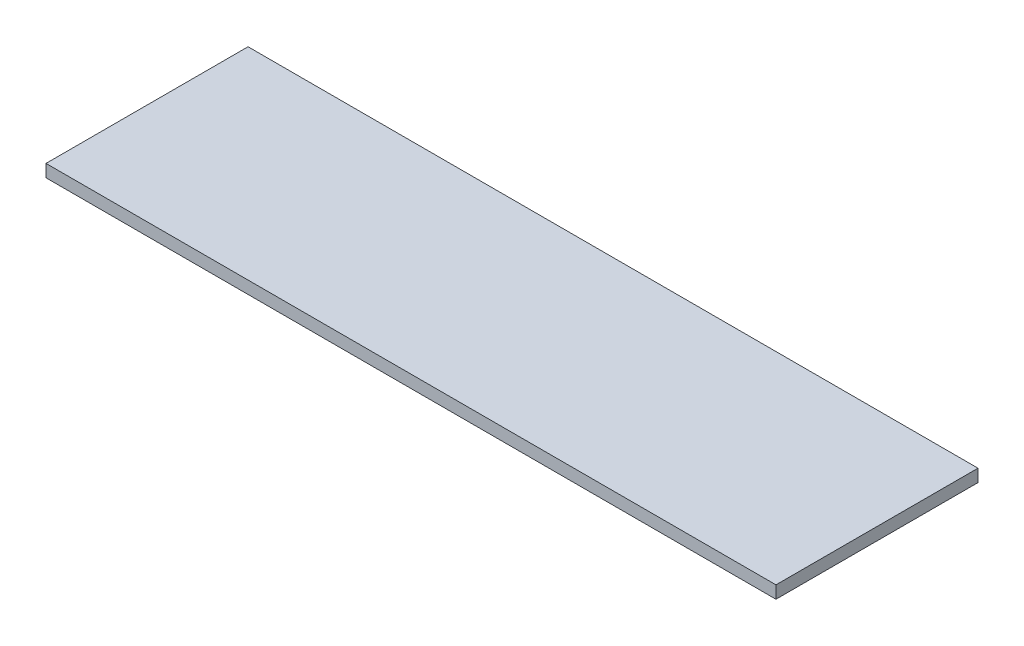
ISO-10303-21;
HEADER;
FILE_DESCRIPTION(('STEP AP214'),'2;1');
FILE_NAME('part.step','',(''),(''),'','','');
FILE_SCHEMA(('AUTOMOTIVE_DESIGN { 1 0 10303 214 1 1 1 1 }'));
ENDSEC;
DATA;
#1=APPLICATION_CONTEXT('core data for automotive mechanical design processes');
#2=APPLICATION_PROTOCOL_DEFINITION('international standard','automotive_design',2000,#1);
#3=PRODUCT_CONTEXT('',#1,'mechanical');
#4=PRODUCT('Part','Part','',(#3));
#5=PRODUCT_RELATED_PRODUCT_CATEGORY('part','',(#4));
#6=PRODUCT_DEFINITION_FORMATION('','',#4);
#7=PRODUCT_DEFINITION_CONTEXT('part definition',#1,'design');
#8=PRODUCT_DEFINITION('design','',#6,#7);
#9=PRODUCT_DEFINITION_SHAPE('','',#8);
#10=(LENGTH_UNIT() NAMED_UNIT(*) SI_UNIT(.MILLI.,.METRE.));
#11=(NAMED_UNIT(*) PLANE_ANGLE_UNIT() SI_UNIT($,.RADIAN.));
#12=(NAMED_UNIT(*) SI_UNIT($,.STERADIAN.) SOLID_ANGLE_UNIT());
#13=UNCERTAINTY_MEASURE_WITH_UNIT(LENGTH_MEASURE(1.E-05),#10,'distance_accuracy_value','');
#14=(GEOMETRIC_REPRESENTATION_CONTEXT(3) GLOBAL_UNCERTAINTY_ASSIGNED_CONTEXT((#13)) GLOBAL_UNIT_ASSIGNED_CONTEXT((#10,
#11,#12)) REPRESENTATION_CONTEXT('',''));
#15=CARTESIAN_POINT('',(0.,0.,0.));
#16=DIRECTION('',(0.,0.,1.));
#17=DIRECTION('',(1.,0.,0.));
#18=AXIS2_PLACEMENT_3D('',#15,#16,#17);
#19=CARTESIAN_POINT('',(533.4,18.25625,147.6375));
#20=DIRECTION('',(-1.,0.,0.));
#21=DIRECTION('',(0.,0.,1.));
#22=AXIS2_PLACEMENT_3D('',#19,#20,#21);
#23=PLANE('',#22);
#24=DIRECTION('',(0.,0.,-1.));
#25=VECTOR('',#24,1.);
#26=CARTESIAN_POINT('',(533.4,0.,147.6375));
#27=LINE('',#26,#25);
#28=CARTESIAN_POINT('',(533.4,0.,147.6375));
#29=VERTEX_POINT('',#28);
#30=CARTESIAN_POINT('',(533.4,0.,-147.6375));
#31=VERTEX_POINT('',#30);
#32=EDGE_CURVE('E95',#29,#31,#27,.T.);
#33=ORIENTED_EDGE('',*,*,#32,.T.);
#34=DIRECTION('',(0.,-1.,0.));
#35=VECTOR('',#34,1.);
#36=CARTESIAN_POINT('',(533.4,18.25625,-147.6375));
#37=LINE('',#36,#35);
#38=CARTESIAN_POINT('',(533.4,18.25625,-147.6375));
#39=VERTEX_POINT('',#38);
#40=EDGE_CURVE('E11',#39,#31,#37,.T.);
#41=ORIENTED_EDGE('',*,*,#40,.F.);
#42=DIRECTION('',(0.,0.,-1.));
#43=VECTOR('',#42,1.);
#44=CARTESIAN_POINT('',(533.4,18.25625,147.6375));
#45=LINE('',#44,#43);
#46=CARTESIAN_POINT('',(533.4,18.25625,147.6375));
#47=VERTEX_POINT('',#46);
#48=EDGE_CURVE('E83',#47,#39,#45,.T.);
#49=ORIENTED_EDGE('',*,*,#48,.F.);
#50=DIRECTION('',(0.,-1.,0.));
#51=VECTOR('',#50,1.);
#52=CARTESIAN_POINT('',(533.4,18.25625,147.6375));
#53=LINE('',#52,#51);
#54=EDGE_CURVE('E91',#47,#29,#53,.T.);
#55=ORIENTED_EDGE('',*,*,#54,.T.);
#56=EDGE_LOOP('',(#33,#41,#49,#55));
#57=FACE_BOUND('',#56,.T.);
#58=ADVANCED_FACE('F32',(#57),#23,.F.);
#59=CARTESIAN_POINT('',(-533.4,18.25625,-147.6375));
#60=DIRECTION('',(0.,0.,1.));
#61=DIRECTION('',(1.,0.,0.));
#62=AXIS2_PLACEMENT_3D('',#59,#60,#61);
#63=PLANE('',#62);
#64=DIRECTION('',(-1.,0.,0.));
#65=VECTOR('',#64,1.);
#66=CARTESIAN_POINT('',(-533.4,0.,-147.6375));
#67=LINE('',#66,#65);
#68=CARTESIAN_POINT('',(-533.4,0.,-147.6375));
#69=VERTEX_POINT('',#68);
#70=EDGE_CURVE('E87',#31,#69,#67,.T.);
#71=ORIENTED_EDGE('',*,*,#70,.T.);
#72=DIRECTION('',(0.,-1.,0.));
#73=VECTOR('',#72,1.);
#74=CARTESIAN_POINT('',(-533.4,18.25625,-147.6375));
#75=LINE('',#74,#73);
#76=CARTESIAN_POINT('',(-533.4,18.25625,-147.6375));
#77=VERTEX_POINT('',#76);
#78=EDGE_CURVE('E40',#77,#69,#75,.T.);
#79=ORIENTED_EDGE('',*,*,#78,.F.);
#80=DIRECTION('',(-1.,0.,0.));
#81=VECTOR('',#80,1.);
#82=CARTESIAN_POINT('',(-533.4,18.25625,-147.6375));
#83=LINE('',#82,#81);
#84=EDGE_CURVE('E78',#39,#77,#83,.T.);
#85=ORIENTED_EDGE('',*,*,#84,.F.);
#86=ORIENTED_EDGE('',*,*,#40,.T.);
#87=EDGE_LOOP('',(#71,#79,#85,#86));
#88=FACE_BOUND('',#87,.T.);
#89=ADVANCED_FACE('F86',(#88),#63,.F.);
#90=CARTESIAN_POINT('',(-533.4,18.25625,147.6375));
#91=DIRECTION('',(1.,0.,0.));
#92=DIRECTION('',(0.,0.,-1.));
#93=AXIS2_PLACEMENT_3D('',#90,#91,#92);
#94=PLANE('',#93);
#95=DIRECTION('',(0.,0.,1.));
#96=VECTOR('',#95,1.);
#97=CARTESIAN_POINT('',(-533.4,0.,147.6375));
#98=LINE('',#97,#96);
#99=CARTESIAN_POINT('',(-533.4,0.,147.6375));
#100=VERTEX_POINT('',#99);
#101=EDGE_CURVE('E65',#69,#100,#98,.T.);
#102=ORIENTED_EDGE('',*,*,#101,.T.);
#103=DIRECTION('',(0.,-1.,0.));
#104=VECTOR('',#103,1.);
#105=CARTESIAN_POINT('',(-533.4,18.25625,147.6375));
#106=LINE('',#105,#104);
#107=CARTESIAN_POINT('',(-533.4,18.25625,147.6375));
#108=VERTEX_POINT('',#107);
#109=EDGE_CURVE('E88',#108,#100,#106,.T.);
#110=ORIENTED_EDGE('',*,*,#109,.F.);
#111=DIRECTION('',(0.,0.,1.));
#112=VECTOR('',#111,1.);
#113=CARTESIAN_POINT('',(-533.4,18.25625,147.6375));
#114=LINE('',#113,#112);
#115=EDGE_CURVE('E81',#77,#108,#114,.T.);
#116=ORIENTED_EDGE('',*,*,#115,.F.);
#117=ORIENTED_EDGE('',*,*,#78,.T.);
#118=EDGE_LOOP('',(#102,#110,#116,#117));
#119=FACE_BOUND('',#118,.T.);
#120=ADVANCED_FACE('F89',(#119),#94,.F.);
#121=CARTESIAN_POINT('',(-533.4,18.25625,147.6375));
#122=DIRECTION('',(0.,0.,-1.));
#123=DIRECTION('',(-1.,0.,0.));
#124=AXIS2_PLACEMENT_3D('',#121,#122,#123);
#125=PLANE('',#124);
#126=DIRECTION('',(1.,0.,0.));
#127=VECTOR('',#126,1.);
#128=CARTESIAN_POINT('',(-533.4,0.,147.6375));
#129=LINE('',#128,#127);
#130=EDGE_CURVE('E71',#100,#29,#129,.T.);
#131=ORIENTED_EDGE('',*,*,#130,.T.);
#132=ORIENTED_EDGE('',*,*,#54,.F.);
#133=DIRECTION('',(1.,0.,0.));
#134=VECTOR('',#133,1.);
#135=CARTESIAN_POINT('',(-533.4,18.25625,147.6375));
#136=LINE('',#135,#134);
#137=EDGE_CURVE('E48',#108,#47,#136,.T.);
#138=ORIENTED_EDGE('',*,*,#137,.F.);
#139=ORIENTED_EDGE('',*,*,#109,.T.);
#140=EDGE_LOOP('',(#131,#132,#138,#139));
#141=FACE_BOUND('',#140,.T.);
#142=ADVANCED_FACE('F102',(#141),#125,.F.);
#143=CARTESIAN_POINT('',(0.,18.25625,0.));
#144=DIRECTION('',(0.,-1.,0.));
#145=DIRECTION('',(0.,0.,-1.));
#146=AXIS2_PLACEMENT_3D('',#143,#144,#145);
#147=PLANE('',#146);
#148=ORIENTED_EDGE('',*,*,#48,.T.);
#149=ORIENTED_EDGE('',*,*,#84,.T.);
#150=ORIENTED_EDGE('',*,*,#115,.T.);
#151=ORIENTED_EDGE('',*,*,#137,.T.);
#152=EDGE_LOOP('',(#148,#149,#150,#151));
#153=FACE_BOUND('',#152,.T.);
#154=ADVANCED_FACE('F79',(#153),#147,.F.);
#155=CARTESIAN_POINT('',(0.,0.,0.));
#156=DIRECTION('',(0.,-1.,0.));
#157=DIRECTION('',(0.,0.,-1.));
#158=AXIS2_PLACEMENT_3D('',#155,#156,#157);
#159=PLANE('',#158);
#160=ORIENTED_EDGE('',*,*,#32,.F.);
#161=ORIENTED_EDGE('',*,*,#130,.F.);
#162=ORIENTED_EDGE('',*,*,#101,.F.);
#163=ORIENTED_EDGE('',*,*,#70,.F.);
#164=EDGE_LOOP('',(#160,#161,#162,#163));
#165=FACE_BOUND('',#164,.T.);
#166=ADVANCED_FACE('F105',(#165),#159,.T.);
#167=CLOSED_SHELL('',(#58,#89,#120,#142,#154,#166));
#168=MANIFOLD_SOLID_BREP('B2',#167);
#169=ADVANCED_BREP_SHAPE_REPRESENTATION('',(#18,#168),#14);
#170=SHAPE_DEFINITION_REPRESENTATION(#9,#169);
ENDSEC;
END-ISO-10303-21;
